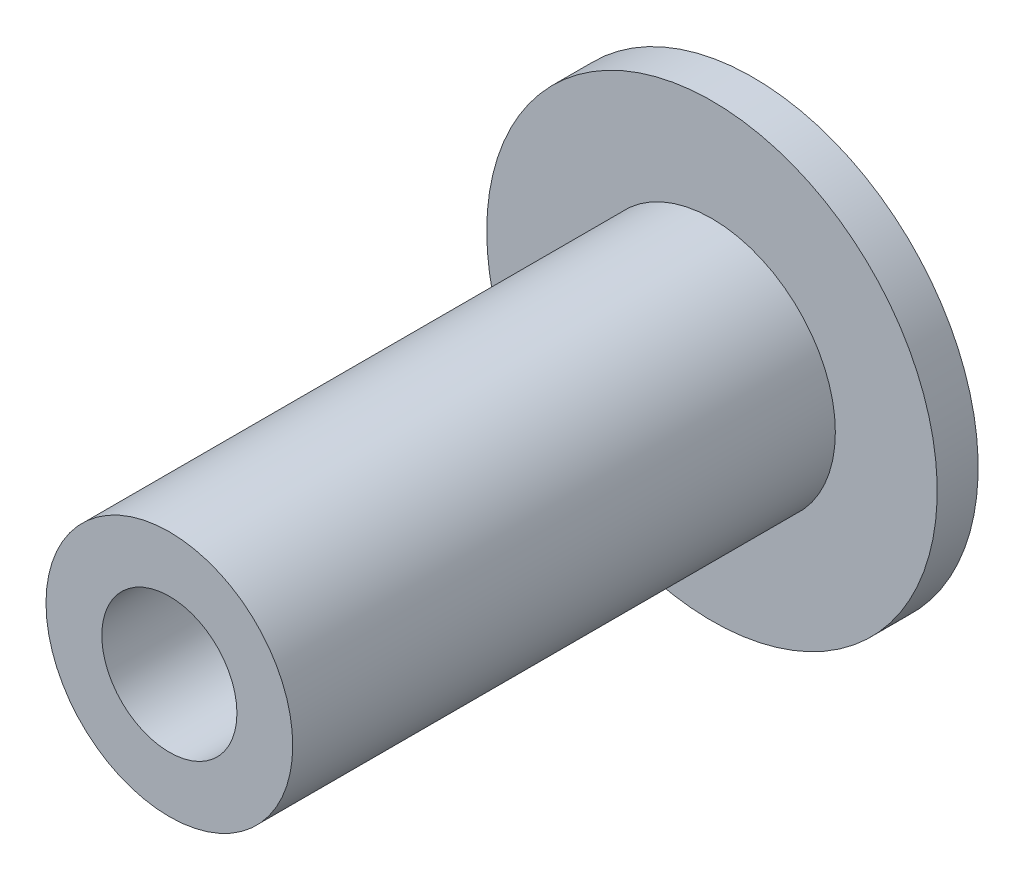
ISO-10303-21;
HEADER;
FILE_DESCRIPTION(('STEP AP214'),'2;1');
FILE_NAME('part.step','',(''),(''),'','','');
FILE_SCHEMA(('AUTOMOTIVE_DESIGN { 1 0 10303 214 1 1 1 1 }'));
ENDSEC;
DATA;
#1=APPLICATION_CONTEXT('core data for automotive mechanical design processes');
#2=APPLICATION_PROTOCOL_DEFINITION('international standard','automotive_design',2000,#1);
#3=PRODUCT_CONTEXT('',#1,'mechanical');
#4=PRODUCT('Part','Part','',(#3));
#5=PRODUCT_RELATED_PRODUCT_CATEGORY('part','',(#4));
#6=PRODUCT_DEFINITION_FORMATION('','',#4);
#7=PRODUCT_DEFINITION_CONTEXT('part definition',#1,'design');
#8=PRODUCT_DEFINITION('design','',#6,#7);
#9=PRODUCT_DEFINITION_SHAPE('','',#8);
#10=(LENGTH_UNIT() NAMED_UNIT(*) SI_UNIT(.MILLI.,.METRE.));
#11=(NAMED_UNIT(*) PLANE_ANGLE_UNIT() SI_UNIT($,.RADIAN.));
#12=(NAMED_UNIT(*) SI_UNIT($,.STERADIAN.) SOLID_ANGLE_UNIT());
#13=UNCERTAINTY_MEASURE_WITH_UNIT(LENGTH_MEASURE(1.E-05),#10,'distance_accuracy_value','');
#14=(GEOMETRIC_REPRESENTATION_CONTEXT(3) GLOBAL_UNCERTAINTY_ASSIGNED_CONTEXT((#13)) GLOBAL_UNIT_ASSIGNED_CONTEXT((#10,
#11,#12)) REPRESENTATION_CONTEXT('',''));
#15=CARTESIAN_POINT('',(0.,0.,0.));
#16=DIRECTION('',(0.,0.,1.));
#17=DIRECTION('',(1.,0.,0.));
#18=AXIS2_PLACEMENT_3D('',#15,#16,#17);
#19=CARTESIAN_POINT('',(0.,0.,10.));
#20=DIRECTION('',(0.,0.,-1.));
#21=DIRECTION('',(-1.,0.,0.));
#22=AXIS2_PLACEMENT_3D('',#19,#20,#21);
#23=CYLINDRICAL_SURFACE('',#22,6.025);
#24=CARTESIAN_POINT('',(0.,0.,0.));
#25=DIRECTION('',(0.,0.,1.));
#26=DIRECTION('',(1.,0.,0.));
#27=AXIS2_PLACEMENT_3D('',#24,#25,#26);
#28=CIRCLE('',#27,6.025);
#29=CARTESIAN_POINT('',(6.025,0.,0.));
#30=VERTEX_POINT('',#29);
#31=EDGE_CURVE('E34',#30,#30,#28,.T.);
#32=ORIENTED_EDGE('',*,*,#31,.T.);
#33=EDGE_LOOP('',(#32));
#34=FACE_BOUND('',#33,.T.);
#35=CARTESIAN_POINT('',(0.,0.,26.5));
#36=DIRECTION('',(0.,0.,1.));
#37=DIRECTION('',(1.,0.,0.));
#38=AXIS2_PLACEMENT_3D('',#35,#36,#37);
#39=CIRCLE('',#38,6.025);
#40=CARTESIAN_POINT('',(6.025,0.,26.5));
#41=VERTEX_POINT('',#40);
#42=EDGE_CURVE('E10',#41,#41,#39,.T.);
#43=ORIENTED_EDGE('',*,*,#42,.F.);
#44=EDGE_LOOP('',(#43));
#45=FACE_BOUND('',#44,.T.);
#46=ADVANCED_FACE('F31',(#34,#45),#23,.T.);
#47=CARTESIAN_POINT('',(0.,0.,26.5));
#48=DIRECTION('',(0.,0.,1.));
#49=DIRECTION('',(1.,0.,0.));
#50=AXIS2_PLACEMENT_3D('',#47,#48,#49);
#51=PLANE('',#50);
#52=CARTESIAN_POINT('',(0.,0.,26.5));
#53=DIRECTION('',(0.,0.,1.));
#54=DIRECTION('',(1.,0.,0.));
#55=AXIS2_PLACEMENT_3D('',#52,#53,#54);
#56=CIRCLE('',#55,3.3);
#57=CARTESIAN_POINT('',(3.3,0.,26.5));
#58=VERTEX_POINT('',#57);
#59=EDGE_CURVE('E49',#58,#58,#56,.T.);
#60=ORIENTED_EDGE('',*,*,#59,.F.);
#61=EDGE_LOOP('',(#60));
#62=FACE_BOUND('',#61,.T.);
#63=ORIENTED_EDGE('',*,*,#42,.T.);
#64=EDGE_LOOP('',(#63));
#65=FACE_BOUND('',#64,.T.);
#66=ADVANCED_FACE('F65',(#62,#65),#51,.T.);
#67=CARTESIAN_POINT('',(0.,0.,-2.));
#68=DIRECTION('',(0.,0.,1.));
#69=DIRECTION('',(1.,0.,0.));
#70=AXIS2_PLACEMENT_3D('',#67,#68,#69);
#71=CYLINDRICAL_SURFACE('',#70,11.);
#72=CARTESIAN_POINT('',(0.,0.,-2.));
#73=DIRECTION('',(0.,0.,-1.));
#74=DIRECTION('',(-1.,0.,0.));
#75=AXIS2_PLACEMENT_3D('',#72,#73,#74);
#76=CIRCLE('',#75,11.);
#77=CARTESIAN_POINT('',(-11.,0.,-2.));
#78=VERTEX_POINT('',#77);
#79=EDGE_CURVE('E41',#78,#78,#76,.T.);
#80=ORIENTED_EDGE('',*,*,#79,.F.);
#81=EDGE_LOOP('',(#80));
#82=FACE_BOUND('',#81,.T.);
#83=CARTESIAN_POINT('',(0.,0.,0.));
#84=DIRECTION('',(0.,0.,-1.));
#85=DIRECTION('',(-1.,0.,0.));
#86=AXIS2_PLACEMENT_3D('',#83,#84,#85);
#87=CIRCLE('',#86,11.);
#88=CARTESIAN_POINT('',(-11.,0.,0.));
#89=VERTEX_POINT('',#88);
#90=EDGE_CURVE('E43',#89,#89,#87,.T.);
#91=ORIENTED_EDGE('',*,*,#90,.T.);
#92=EDGE_LOOP('',(#91));
#93=FACE_BOUND('',#92,.T.);
#94=ADVANCED_FACE('F67',(#82,#93),#71,.T.);
#95=CARTESIAN_POINT('',(0.,0.,-2.));
#96=DIRECTION('',(0.,0.,-1.));
#97=DIRECTION('',(-1.,0.,0.));
#98=AXIS2_PLACEMENT_3D('',#95,#96,#97);
#99=PLANE('',#98);
#100=CARTESIAN_POINT('',(0.,0.,-2.));
#101=DIRECTION('',(0.,0.,1.));
#102=DIRECTION('',(1.,0.,0.));
#103=AXIS2_PLACEMENT_3D('',#100,#101,#102);
#104=CIRCLE('',#103,3.3);
#105=CARTESIAN_POINT('',(3.3,0.,-2.));
#106=VERTEX_POINT('',#105);
#107=EDGE_CURVE('E46',#106,#106,#104,.T.);
#108=ORIENTED_EDGE('',*,*,#107,.T.);
#109=EDGE_LOOP('',(#108));
#110=FACE_BOUND('',#109,.T.);
#111=ORIENTED_EDGE('',*,*,#79,.T.);
#112=EDGE_LOOP('',(#111));
#113=FACE_BOUND('',#112,.T.);
#114=ADVANCED_FACE('F55',(#110,#113),#99,.T.);
#115=CARTESIAN_POINT('',(0.,0.,0.));
#116=DIRECTION('',(0.,0.,-1.));
#117=DIRECTION('',(-1.,0.,0.));
#118=AXIS2_PLACEMENT_3D('',#115,#116,#117);
#119=PLANE('',#118);
#120=ORIENTED_EDGE('',*,*,#31,.F.);
#121=EDGE_LOOP('',(#120));
#122=FACE_BOUND('',#121,.T.);
#123=ORIENTED_EDGE('',*,*,#90,.F.);
#124=EDGE_LOOP('',(#123));
#125=FACE_BOUND('',#124,.T.);
#126=ADVANCED_FACE('F61',(#122,#125),#119,.F.);
#127=CARTESIAN_POINT('',(0.,0.,-2.));
#128=DIRECTION('',(0.,0.,1.));
#129=DIRECTION('',(1.,0.,0.));
#130=AXIS2_PLACEMENT_3D('',#127,#128,#129);
#131=CYLINDRICAL_SURFACE('',#130,3.3);
#132=ORIENTED_EDGE('',*,*,#107,.F.);
#133=EDGE_LOOP('',(#132));
#134=FACE_BOUND('',#133,.T.);
#135=ORIENTED_EDGE('',*,*,#59,.T.);
#136=EDGE_LOOP('',(#135));
#137=FACE_BOUND('',#136,.T.);
#138=ADVANCED_FACE('F58',(#134,#137),#131,.F.);
#139=CLOSED_SHELL('',(#46,#66,#94,#114,#126,#138));
#140=MANIFOLD_SOLID_BREP('B2',#139);
#141=ADVANCED_BREP_SHAPE_REPRESENTATION('',(#18,#140),#14);
#142=SHAPE_DEFINITION_REPRESENTATION(#9,#141);
ENDSEC;
END-ISO-10303-21;
